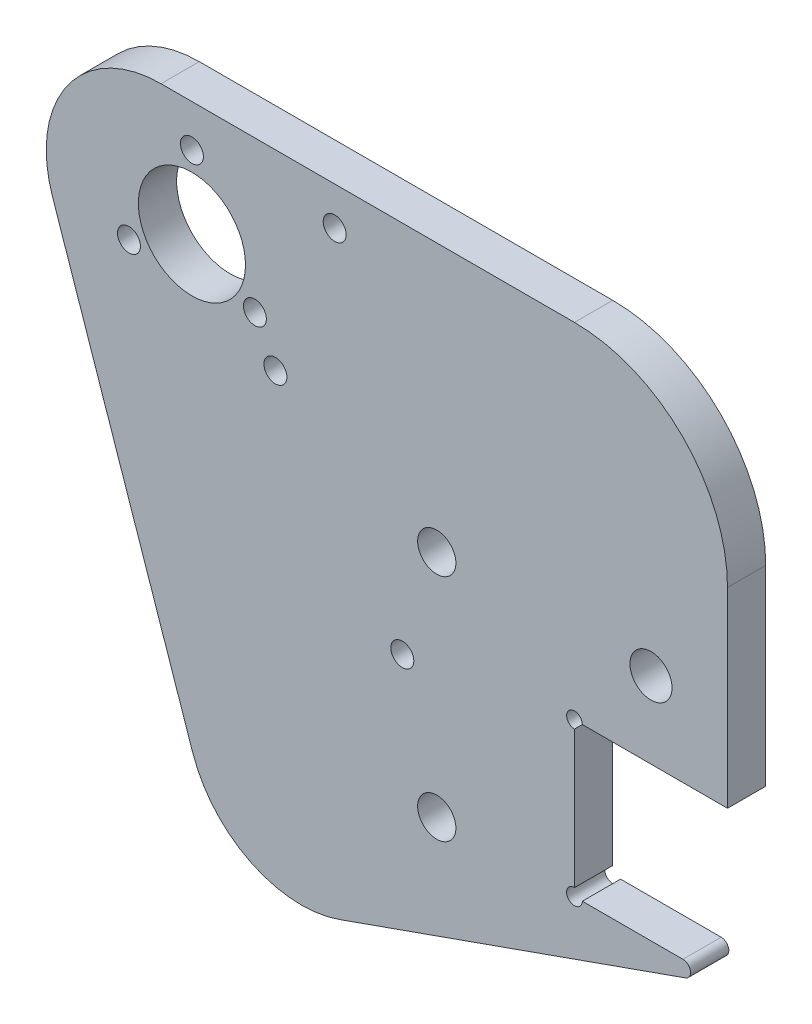
ISO-10303-21;
HEADER;
FILE_DESCRIPTION(('STEP AP214'),'2;1');
FILE_NAME('part.step','',(''),(''),'','','');
FILE_SCHEMA(('AUTOMOTIVE_DESIGN { 1 0 10303 214 1 1 1 1 }'));
ENDSEC;
DATA;
#1=APPLICATION_CONTEXT('core data for automotive mechanical design processes');
#2=APPLICATION_PROTOCOL_DEFINITION('international standard','automotive_design',2000,#1);
#3=PRODUCT_CONTEXT('',#1,'mechanical');
#4=PRODUCT('Part','Part','',(#3));
#5=PRODUCT_RELATED_PRODUCT_CATEGORY('part','',(#4));
#6=PRODUCT_DEFINITION_FORMATION('','',#4);
#7=PRODUCT_DEFINITION_CONTEXT('part definition',#1,'design');
#8=PRODUCT_DEFINITION('design','',#6,#7);
#9=PRODUCT_DEFINITION_SHAPE('','',#8);
#10=(LENGTH_UNIT() NAMED_UNIT(*) SI_UNIT(.MILLI.,.METRE.));
#11=(NAMED_UNIT(*) PLANE_ANGLE_UNIT() SI_UNIT($,.RADIAN.));
#12=(NAMED_UNIT(*) SI_UNIT($,.STERADIAN.) SOLID_ANGLE_UNIT());
#13=UNCERTAINTY_MEASURE_WITH_UNIT(LENGTH_MEASURE(1.E-05),#10,'distance_accuracy_value','');
#14=(GEOMETRIC_REPRESENTATION_CONTEXT(3) GLOBAL_UNCERTAINTY_ASSIGNED_CONTEXT((#13)) GLOBAL_UNIT_ASSIGNED_CONTEXT((#10,
#11,#12)) REPRESENTATION_CONTEXT('',''));
#15=CARTESIAN_POINT('',(0.,0.,0.));
#16=DIRECTION('',(0.,0.,1.));
#17=DIRECTION('',(1.,0.,0.));
#18=AXIS2_PLACEMENT_3D('',#15,#16,#17);
#19=CARTESIAN_POINT('',(50.,-5.,-5.));
#20=DIRECTION('',(0.,0.,-1.));
#21=DIRECTION('',(1.,0.,0.));
#22=AXIS2_PLACEMENT_3D('',#19,#20,#21);
#23=PLANE('',#22);
#24=CARTESIAN_POINT('',(50.,-50.,-5.));
#25=DIRECTION('',(0.,0.,1.));
#26=DIRECTION('',(1.,0.,0.));
#27=AXIS2_PLACEMENT_3D('',#24,#25,#26);
#28=CIRCLE('',#27,1.025);
#29=CARTESIAN_POINT('',(50.,-48.975,-5.));
#30=VERTEX_POINT('',#29);
#31=CARTESIAN_POINT('',(51.025,-50.,-5.));
#32=VERTEX_POINT('',#31);
#33=EDGE_CURVE('E145',#30,#32,#28,.T.);
#34=ORIENTED_EDGE('',*,*,#33,.T.);
#35=DIRECTION('',(-1.,0.,0.));
#36=VECTOR('',#35,1.);
#37=CARTESIAN_POINT('',(50.,-50.,-5.));
#38=LINE('',#37,#36);
#39=CARTESIAN_POINT('',(64.1761192737499,-50.,-5.));
#40=VERTEX_POINT('',#39);
#41=EDGE_CURVE('E135',#40,#32,#38,.T.);
#42=ORIENTED_EDGE('',*,*,#41,.F.);
#43=CARTESIAN_POINT('',(64.1761192737499,-51.,-5.));
#44=DIRECTION('',(0.,0.,1.));
#45=DIRECTION('',(1.,0.,0.));
#46=AXIS2_PLACEMENT_3D('',#43,#44,#45);
#47=CIRCLE('',#46,1.);
#48=CARTESIAN_POINT('',(64.5096979241888,-51.9427222729794,-5.));
#49=VERTEX_POINT('',#48);
#50=EDGE_CURVE('E137',#49,#40,#47,.T.);
#51=ORIENTED_EDGE('',*,*,#50,.F.);
#52=DIRECTION('',(0.942722272979372,0.333578650438854,0.));
#53=VECTOR('',#52,1.);
#54=CARTESIAN_POINT('',(19.3050246890061,-67.9382220331209,-5.));
#55=LINE('',#54,#53);
#56=CARTESIAN_POINT('',(19.3050246890061,-67.9382220331209,-5.));
#57=VERTEX_POINT('',#56);
#58=EDGE_CURVE('E272',#57,#49,#55,.T.);
#59=ORIENTED_EDGE('',*,*,#58,.F.);
#60=CARTESIAN_POINT('',(14.3013449324233,-53.7973879384304,-5.));
#61=DIRECTION('',(0.,0.,1.));
#62=DIRECTION('',(1.,0.,0.));
#63=AXIS2_PLACEMENT_3D('',#60,#61,#62);
#64=CIRCLE('',#63,15.);
#65=CARTESIAN_POINT('',(0.103692109745153,-58.6374968552524,-5.));
#66=VERTEX_POINT('',#65);
#67=EDGE_CURVE('E269',#66,#57,#64,.T.);
#68=ORIENTED_EDGE('',*,*,#67,.F.);
#69=DIRECTION('',(0.322673927788139,-0.94651018817854,0.));
#70=VECTOR('',#69,1.);
#71=CARTESIAN_POINT('',(-18.2363265056288,-4.84010891682209,-5.));
#72=LINE('',#71,#70);
#73=CARTESIAN_POINT('',(-18.2363265056288,-4.84010891682209,-5.));
#74=VERTEX_POINT('',#73);
#75=EDGE_CURVE('E266',#74,#66,#72,.T.);
#76=ORIENTED_EDGE('',*,*,#75,.F.);
#77=CARTESIAN_POINT('',(-4.03867368295073,0.,-5.));
#78=DIRECTION('',(0.,0.,1.));
#79=DIRECTION('',(1.,0.,0.));
#80=AXIS2_PLACEMENT_3D('',#77,#78,#79);
#81=CIRCLE('',#80,15.);
#82=CARTESIAN_POINT('',(-4.03867368295073,15.,-5.));
#83=VERTEX_POINT('',#82);
#84=EDGE_CURVE('E263',#83,#74,#81,.T.);
#85=ORIENTED_EDGE('',*,*,#84,.F.);
#86=DIRECTION('',(-1.,0.,0.));
#87=VECTOR('',#86,1.);
#88=CARTESIAN_POINT('',(50.,15.,-5.));
#89=LINE('',#88,#87);
#90=CARTESIAN_POINT('',(50.,15.,-5.));
#91=VERTEX_POINT('',#90);
#92=EDGE_CURVE('E260',#91,#83,#89,.T.);
#93=ORIENTED_EDGE('',*,*,#92,.F.);
#94=CARTESIAN_POINT('',(50.,-5.,-5.));
#95=DIRECTION('',(0.,0.,1.));
#96=DIRECTION('',(1.,0.,0.));
#97=AXIS2_PLACEMENT_3D('',#94,#95,#96);
#98=CIRCLE('',#97,20.);
#99=CARTESIAN_POINT('',(70.,-5.,-5.));
#100=VERTEX_POINT('',#99);
#101=EDGE_CURVE('E257',#100,#91,#98,.T.);
#102=ORIENTED_EDGE('',*,*,#101,.F.);
#103=DIRECTION('',(0.,1.,0.));
#104=VECTOR('',#103,1.);
#105=CARTESIAN_POINT('',(70.,-30.,-5.));
#106=LINE('',#105,#104);
#107=CARTESIAN_POINT('',(70.,-30.,-5.));
#108=VERTEX_POINT('',#107);
#109=EDGE_CURVE('E254',#108,#100,#106,.T.);
#110=ORIENTED_EDGE('',*,*,#109,.F.);
#111=DIRECTION('',(1.,0.,0.));
#112=VECTOR('',#111,1.);
#113=CARTESIAN_POINT('',(50.,-30.,-5.));
#114=LINE('',#113,#112);
#115=CARTESIAN_POINT('',(51.025,-30.,-5.));
#116=VERTEX_POINT('',#115);
#117=EDGE_CURVE('E156',#116,#108,#114,.T.);
#118=ORIENTED_EDGE('',*,*,#117,.F.);
#119=CARTESIAN_POINT('',(50.,-30.,-5.));
#120=DIRECTION('',(0.,0.,1.));
#121=DIRECTION('',(1.,0.,0.));
#122=AXIS2_PLACEMENT_3D('',#119,#120,#121);
#123=CIRCLE('',#122,1.025);
#124=CARTESIAN_POINT('',(50.,-31.025,-5.));
#125=VERTEX_POINT('',#124);
#126=EDGE_CURVE('E208',#116,#125,#123,.T.);
#127=ORIENTED_EDGE('',*,*,#126,.T.);
#128=DIRECTION('',(0.,1.,0.));
#129=VECTOR('',#128,1.);
#130=CARTESIAN_POINT('',(50.,-50.,-5.));
#131=LINE('',#130,#129);
#132=EDGE_CURVE('E152',#30,#125,#131,.T.);
#133=ORIENTED_EDGE('',*,*,#132,.F.);
#134=EDGE_LOOP('',(#34,#42,#51,#59,#68,#76,#85,#93,#102,#110,#118,#127,#133));
#135=FACE_BOUND('',#134,.T.);
#136=CARTESIAN_POINT('',(10.914424011663,-10.,-5.));
#137=DIRECTION('',(0.,0.,1.));
#138=DIRECTION('',(1.,0.,0.));
#139=AXIS2_PLACEMENT_3D('',#136,#137,#138);
#140=CIRCLE('',#139,1.50000000000242);
#141=CARTESIAN_POINT('',(12.4144240116654,-10.,-5.));
#142=VERTEX_POINT('',#141);
#143=EDGE_CURVE('E197',#142,#142,#140,.T.);
#144=ORIENTED_EDGE('',*,*,#143,.T.);
#145=EDGE_LOOP('',(#144));
#146=FACE_BOUND('',#145,.T.);
#147=CARTESIAN_POINT('',(27.5,-33.82,-5.));
#148=DIRECTION('',(0.,0.,1.));
#149=DIRECTION('',(1.,0.,0.));
#150=AXIS2_PLACEMENT_3D('',#147,#148,#149);
#151=CIRCLE('',#150,1.5);
#152=CARTESIAN_POINT('',(29.,-33.82,-5.));
#153=VERTEX_POINT('',#152);
#154=EDGE_CURVE('E187',#153,#153,#151,.T.);
#155=ORIENTED_EDGE('',*,*,#154,.T.);
#156=EDGE_LOOP('',(#155));
#157=FACE_BOUND('',#156,.T.);
#158=CARTESIAN_POINT('',(18.66,10.,-5.));
#159=DIRECTION('',(0.,0.,1.));
#160=DIRECTION('',(1.,0.,0.));
#161=AXIS2_PLACEMENT_3D('',#158,#159,#160);
#162=CIRCLE('',#161,1.5);
#163=CARTESIAN_POINT('',(20.16,10.,-5.));
#164=VERTEX_POINT('',#163);
#165=EDGE_CURVE('E201',#164,#164,#162,.T.);
#166=ORIENTED_EDGE('',*,*,#165,.T.);
#167=EDGE_LOOP('',(#166));
#168=FACE_BOUND('',#167,.T.);
#169=CARTESIAN_POINT('',(60.0000000000001,-20.0000000000002,-5.));
#170=DIRECTION('',(0.,0.,1.));
#171=DIRECTION('',(1.,0.,0.));
#172=AXIS2_PLACEMENT_3D('',#169,#170,#171);
#173=CIRCLE('',#172,2.75000000000005);
#174=CARTESIAN_POINT('',(62.7500000000001,-20.0000000000002,-5.));
#175=VERTEX_POINT('',#174);
#176=EDGE_CURVE('E196',#175,#175,#173,.T.);
#177=ORIENTED_EDGE('',*,*,#176,.T.);
#178=EDGE_LOOP('',(#177));
#179=FACE_BOUND('',#178,.T.);
#180=CARTESIAN_POINT('',(32.,-50.,-5.));
#181=DIRECTION('',(0.,0.,1.));
#182=DIRECTION('',(1.,0.,0.));
#183=AXIS2_PLACEMENT_3D('',#180,#181,#182);
#184=CIRCLE('',#183,2.5);
#185=CARTESIAN_POINT('',(34.5,-50.,-5.));
#186=VERTEX_POINT('',#185);
#187=EDGE_CURVE('E222',#186,#186,#184,.T.);
#188=ORIENTED_EDGE('',*,*,#187,.T.);
#189=EDGE_LOOP('',(#188));
#190=FACE_BOUND('',#189,.T.);
#191=CARTESIAN_POINT('',(8.22724133595217,-4.75,-5.));
#192=DIRECTION('',(0.,0.,1.));
#193=DIRECTION('',(1.,0.,0.));
#194=AXIS2_PLACEMENT_3D('',#191,#192,#193);
#195=CIRCLE('',#194,1.5);
#196=CARTESIAN_POINT('',(9.72724133595217,-4.75,-5.));
#197=VERTEX_POINT('',#196);
#198=EDGE_CURVE('E234',#197,#197,#195,.T.);
#199=ORIENTED_EDGE('',*,*,#198,.T.);
#200=EDGE_LOOP('',(#199));
#201=FACE_BOUND('',#200,.T.);
#202=CARTESIAN_POINT('',(0.,0.,-5.));
#203=DIRECTION('',(0.,0.,1.));
#204=DIRECTION('',(1.,0.,0.));
#205=AXIS2_PLACEMENT_3D('',#202,#203,#204);
#206=CIRCLE('',#205,7.);
#207=CARTESIAN_POINT('',(7.,0.,-5.));
#208=VERTEX_POINT('',#207);
#209=EDGE_CURVE('E246',#208,#208,#206,.T.);
#210=ORIENTED_EDGE('',*,*,#209,.T.);
#211=EDGE_LOOP('',(#210));
#212=FACE_BOUND('',#211,.T.);
#213=CARTESIAN_POINT('',(0.,9.5,-5.));
#214=DIRECTION('',(0.,0.,1.));
#215=DIRECTION('',(1.,0.,0.));
#216=AXIS2_PLACEMENT_3D('',#213,#214,#215);
#217=CIRCLE('',#216,1.5);
#218=CARTESIAN_POINT('',(1.5,9.5,-5.));
#219=VERTEX_POINT('',#218);
#220=EDGE_CURVE('E240',#219,#219,#217,.T.);
#221=ORIENTED_EDGE('',*,*,#220,.T.);
#222=EDGE_LOOP('',(#221));
#223=FACE_BOUND('',#222,.T.);
#224=CARTESIAN_POINT('',(-8.22724133595217,-4.75,-5.));
#225=DIRECTION('',(0.,0.,1.));
#226=DIRECTION('',(1.,0.,0.));
#227=AXIS2_PLACEMENT_3D('',#224,#225,#226);
#228=CIRCLE('',#227,1.5);
#229=CARTESIAN_POINT('',(-6.72724133595217,-4.75,-5.));
#230=VERTEX_POINT('',#229);
#231=EDGE_CURVE('E228',#230,#230,#228,.T.);
#232=ORIENTED_EDGE('',*,*,#231,.T.);
#233=EDGE_LOOP('',(#232));
#234=FACE_BOUND('',#233,.T.);
#235=CARTESIAN_POINT('',(32.,-20.,-5.));
#236=DIRECTION('',(0.,0.,1.));
#237=DIRECTION('',(1.,0.,0.));
#238=AXIS2_PLACEMENT_3D('',#235,#236,#237);
#239=CIRCLE('',#238,2.5);
#240=CARTESIAN_POINT('',(34.5,-20.,-5.));
#241=VERTEX_POINT('',#240);
#242=EDGE_CURVE('E216',#241,#241,#239,.T.);
#243=ORIENTED_EDGE('',*,*,#242,.T.);
#244=EDGE_LOOP('',(#243));
#245=FACE_BOUND('',#244,.T.);
#246=ADVANCED_FACE('F37',(#135,#146,#157,#168,#179,#190,#201,#212,#223,#234,#245),#23,.T.);
#247=CARTESIAN_POINT('',(50.,-5.,0.));
#248=DIRECTION('',(0.,0.,-1.));
#249=DIRECTION('',(1.,0.,0.));
#250=AXIS2_PLACEMENT_3D('',#247,#248,#249);
#251=PLANE('',#250);
#252=CARTESIAN_POINT('',(10.914424011663,-10.,0.));
#253=DIRECTION('',(0.,0.,1.));
#254=DIRECTION('',(1.,0.,0.));
#255=AXIS2_PLACEMENT_3D('',#252,#253,#254);
#256=CIRCLE('',#255,1.50000000000242);
#257=CARTESIAN_POINT('',(12.4144240116654,-10.,0.));
#258=VERTEX_POINT('',#257);
#259=EDGE_CURVE('E194',#258,#258,#256,.T.);
#260=ORIENTED_EDGE('',*,*,#259,.F.);
#261=EDGE_LOOP('',(#260));
#262=FACE_BOUND('',#261,.T.);
#263=CARTESIAN_POINT('',(27.5,-33.82,0.));
#264=DIRECTION('',(0.,0.,1.));
#265=DIRECTION('',(1.,0.,0.));
#266=AXIS2_PLACEMENT_3D('',#263,#264,#265);
#267=CIRCLE('',#266,1.5);
#268=CARTESIAN_POINT('',(29.,-33.82,0.));
#269=VERTEX_POINT('',#268);
#270=EDGE_CURVE('E190',#269,#269,#267,.T.);
#271=ORIENTED_EDGE('',*,*,#270,.F.);
#272=EDGE_LOOP('',(#271));
#273=FACE_BOUND('',#272,.T.);
#274=CARTESIAN_POINT('',(18.66,10.,0.));
#275=DIRECTION('',(0.,0.,1.));
#276=DIRECTION('',(1.,0.,0.));
#277=AXIS2_PLACEMENT_3D('',#274,#275,#276);
#278=CIRCLE('',#277,1.5);
#279=CARTESIAN_POINT('',(20.16,10.,0.));
#280=VERTEX_POINT('',#279);
#281=EDGE_CURVE('E186',#280,#280,#278,.T.);
#282=ORIENTED_EDGE('',*,*,#281,.F.);
#283=EDGE_LOOP('',(#282));
#284=FACE_BOUND('',#283,.T.);
#285=CARTESIAN_POINT('',(60.0000000000001,-20.0000000000002,0.));
#286=DIRECTION('',(0.,0.,1.));
#287=DIRECTION('',(1.,0.,0.));
#288=AXIS2_PLACEMENT_3D('',#285,#286,#287);
#289=CIRCLE('',#288,2.75000000000005);
#290=CARTESIAN_POINT('',(62.7500000000001,-20.0000000000002,0.));
#291=VERTEX_POINT('',#290);
#292=EDGE_CURVE('E183',#291,#291,#289,.T.);
#293=ORIENTED_EDGE('',*,*,#292,.F.);
#294=EDGE_LOOP('',(#293));
#295=FACE_BOUND('',#294,.T.);
#296=DIRECTION('',(0.,1.,0.));
#297=VECTOR('',#296,1.);
#298=CARTESIAN_POINT('',(50.,-50.,0.));
#299=LINE('',#298,#297);
#300=CARTESIAN_POINT('',(50.,-48.975,0.));
#301=VERTEX_POINT('',#300);
#302=CARTESIAN_POINT('',(50.,-31.025,0.));
#303=VERTEX_POINT('',#302);
#304=EDGE_CURVE('E249',#301,#303,#299,.T.);
#305=ORIENTED_EDGE('',*,*,#304,.T.);
#306=CARTESIAN_POINT('',(50.,-30.,0.));
#307=DIRECTION('',(0.,0.,1.));
#308=DIRECTION('',(1.,0.,0.));
#309=AXIS2_PLACEMENT_3D('',#306,#307,#308);
#310=CIRCLE('',#309,1.025);
#311=CARTESIAN_POINT('',(51.025,-30.,0.));
#312=VERTEX_POINT('',#311);
#313=EDGE_CURVE('E310',#312,#303,#310,.T.);
#314=ORIENTED_EDGE('',*,*,#313,.F.);
#315=DIRECTION('',(1.,0.,0.));
#316=VECTOR('',#315,1.);
#317=CARTESIAN_POINT('',(50.,-30.,0.));
#318=LINE('',#317,#316);
#319=CARTESIAN_POINT('',(70.,-30.,0.));
#320=VERTEX_POINT('',#319);
#321=EDGE_CURVE('E277',#312,#320,#318,.T.);
#322=ORIENTED_EDGE('',*,*,#321,.T.);
#323=DIRECTION('',(0.,1.,0.));
#324=VECTOR('',#323,1.);
#325=CARTESIAN_POINT('',(70.,-30.,0.));
#326=LINE('',#325,#324);
#327=CARTESIAN_POINT('',(70.,-5.,0.));
#328=VERTEX_POINT('',#327);
#329=EDGE_CURVE('E280',#320,#328,#326,.T.);
#330=ORIENTED_EDGE('',*,*,#329,.T.);
#331=CARTESIAN_POINT('',(50.,-5.,0.));
#332=DIRECTION('',(0.,0.,1.));
#333=DIRECTION('',(1.,0.,0.));
#334=AXIS2_PLACEMENT_3D('',#331,#332,#333);
#335=CIRCLE('',#334,20.);
#336=CARTESIAN_POINT('',(50.,15.,0.));
#337=VERTEX_POINT('',#336);
#338=EDGE_CURVE('E283',#328,#337,#335,.T.);
#339=ORIENTED_EDGE('',*,*,#338,.T.);
#340=DIRECTION('',(-1.,0.,0.));
#341=VECTOR('',#340,1.);
#342=CARTESIAN_POINT('',(50.,15.,0.));
#343=LINE('',#342,#341);
#344=CARTESIAN_POINT('',(-4.03867368295073,15.,0.));
#345=VERTEX_POINT('',#344);
#346=EDGE_CURVE('E286',#337,#345,#343,.T.);
#347=ORIENTED_EDGE('',*,*,#346,.T.);
#348=CARTESIAN_POINT('',(-4.03867368295073,0.,0.));
#349=DIRECTION('',(0.,0.,1.));
#350=DIRECTION('',(1.,0.,0.));
#351=AXIS2_PLACEMENT_3D('',#348,#349,#350);
#352=CIRCLE('',#351,15.);
#353=CARTESIAN_POINT('',(-18.2363265056288,-4.84010891682209,0.));
#354=VERTEX_POINT('',#353);
#355=EDGE_CURVE('E289',#345,#354,#352,.T.);
#356=ORIENTED_EDGE('',*,*,#355,.T.);
#357=DIRECTION('',(0.322673927788139,-0.94651018817854,0.));
#358=VECTOR('',#357,1.);
#359=CARTESIAN_POINT('',(-18.2363265056288,-4.84010891682209,0.));
#360=LINE('',#359,#358);
#361=CARTESIAN_POINT('',(0.103692109745153,-58.6374968552524,0.));
#362=VERTEX_POINT('',#361);
#363=EDGE_CURVE('E292',#354,#362,#360,.T.);
#364=ORIENTED_EDGE('',*,*,#363,.T.);
#365=CARTESIAN_POINT('',(14.3013449324233,-53.7973879384304,0.));
#366=DIRECTION('',(0.,0.,1.));
#367=DIRECTION('',(1.,0.,0.));
#368=AXIS2_PLACEMENT_3D('',#365,#366,#367);
#369=CIRCLE('',#368,15.);
#370=CARTESIAN_POINT('',(19.3050246890061,-67.9382220331209,0.));
#371=VERTEX_POINT('',#370);
#372=EDGE_CURVE('E158',#362,#371,#369,.T.);
#373=ORIENTED_EDGE('',*,*,#372,.T.);
#374=DIRECTION('',(0.942722272979372,0.333578650438854,0.));
#375=VECTOR('',#374,1.);
#376=CARTESIAN_POINT('',(19.3050246890061,-67.9382220331209,0.));
#377=LINE('',#376,#375);
#378=CARTESIAN_POINT('',(64.5096979241888,-51.9427222729794,0.));
#379=VERTEX_POINT('',#378);
#380=EDGE_CURVE('E153',#371,#379,#377,.T.);
#381=ORIENTED_EDGE('',*,*,#380,.T.);
#382=CARTESIAN_POINT('',(64.1761192737499,-51.,0.));
#383=DIRECTION('',(0.,0.,1.));
#384=DIRECTION('',(1.,0.,0.));
#385=AXIS2_PLACEMENT_3D('',#382,#383,#384);
#386=CIRCLE('',#385,1.);
#387=CARTESIAN_POINT('',(64.1761192737499,-50.,0.));
#388=VERTEX_POINT('',#387);
#389=EDGE_CURVE('E151',#388,#379,#386,.F.);
#390=ORIENTED_EDGE('',*,*,#389,.F.);
#391=DIRECTION('',(-1.,0.,0.));
#392=VECTOR('',#391,1.);
#393=CARTESIAN_POINT('',(50.,-50.,0.));
#394=LINE('',#393,#392);
#395=CARTESIAN_POINT('',(51.025,-50.,0.));
#396=VERTEX_POINT('',#395);
#397=EDGE_CURVE('E132',#388,#396,#394,.T.);
#398=ORIENTED_EDGE('',*,*,#397,.T.);
#399=CARTESIAN_POINT('',(50.,-50.,0.));
#400=DIRECTION('',(0.,0.,1.));
#401=DIRECTION('',(1.,0.,0.));
#402=AXIS2_PLACEMENT_3D('',#399,#400,#401);
#403=CIRCLE('',#402,1.025);
#404=EDGE_CURVE('E139',#301,#396,#403,.T.);
#405=ORIENTED_EDGE('',*,*,#404,.F.);
#406=EDGE_LOOP('',(#305,#314,#322,#330,#339,#347,#356,#364,#373,#381,#390,#398,#405));
#407=FACE_BOUND('',#406,.T.);
#408=CARTESIAN_POINT('',(0.,0.,0.));
#409=DIRECTION('',(0.,0.,1.));
#410=DIRECTION('',(1.,0.,0.));
#411=AXIS2_PLACEMENT_3D('',#408,#409,#410);
#412=CIRCLE('',#411,7.);
#413=CARTESIAN_POINT('',(7.,0.,0.));
#414=VERTEX_POINT('',#413);
#415=EDGE_CURVE('E243',#414,#414,#412,.T.);
#416=ORIENTED_EDGE('',*,*,#415,.F.);
#417=EDGE_LOOP('',(#416));
#418=FACE_BOUND('',#417,.T.);
#419=CARTESIAN_POINT('',(0.,9.5,0.));
#420=DIRECTION('',(0.,0.,1.));
#421=DIRECTION('',(1.,0.,0.));
#422=AXIS2_PLACEMENT_3D('',#419,#420,#421);
#423=CIRCLE('',#422,1.5);
#424=CARTESIAN_POINT('',(1.5,9.5,0.));
#425=VERTEX_POINT('',#424);
#426=EDGE_CURVE('E237',#425,#425,#423,.T.);
#427=ORIENTED_EDGE('',*,*,#426,.F.);
#428=EDGE_LOOP('',(#427));
#429=FACE_BOUND('',#428,.T.);
#430=CARTESIAN_POINT('',(8.22724133595217,-4.75,0.));
#431=DIRECTION('',(0.,0.,1.));
#432=DIRECTION('',(1.,0.,0.));
#433=AXIS2_PLACEMENT_3D('',#430,#431,#432);
#434=CIRCLE('',#433,1.5);
#435=CARTESIAN_POINT('',(9.72724133595217,-4.75,0.));
#436=VERTEX_POINT('',#435);
#437=EDGE_CURVE('E231',#436,#436,#434,.T.);
#438=ORIENTED_EDGE('',*,*,#437,.F.);
#439=EDGE_LOOP('',(#438));
#440=FACE_BOUND('',#439,.T.);
#441=CARTESIAN_POINT('',(-8.22724133595217,-4.75,0.));
#442=DIRECTION('',(0.,0.,1.));
#443=DIRECTION('',(1.,0.,0.));
#444=AXIS2_PLACEMENT_3D('',#441,#442,#443);
#445=CIRCLE('',#444,1.5);
#446=CARTESIAN_POINT('',(-6.72724133595217,-4.75,0.));
#447=VERTEX_POINT('',#446);
#448=EDGE_CURVE('E225',#447,#447,#445,.T.);
#449=ORIENTED_EDGE('',*,*,#448,.F.);
#450=EDGE_LOOP('',(#449));
#451=FACE_BOUND('',#450,.T.);
#452=CARTESIAN_POINT('',(32.,-50.,0.));
#453=DIRECTION('',(0.,0.,1.));
#454=DIRECTION('',(1.,0.,0.));
#455=AXIS2_PLACEMENT_3D('',#452,#453,#454);
#456=CIRCLE('',#455,2.5);
#457=CARTESIAN_POINT('',(34.5,-50.,0.));
#458=VERTEX_POINT('',#457);
#459=EDGE_CURVE('E219',#458,#458,#456,.T.);
#460=ORIENTED_EDGE('',*,*,#459,.F.);
#461=EDGE_LOOP('',(#460));
#462=FACE_BOUND('',#461,.T.);
#463=CARTESIAN_POINT('',(32.,-20.,0.));
#464=DIRECTION('',(0.,0.,1.));
#465=DIRECTION('',(1.,0.,0.));
#466=AXIS2_PLACEMENT_3D('',#463,#464,#465);
#467=CIRCLE('',#466,2.5);
#468=CARTESIAN_POINT('',(34.5,-20.,0.));
#469=VERTEX_POINT('',#468);
#470=EDGE_CURVE('E193',#469,#469,#467,.T.);
#471=ORIENTED_EDGE('',*,*,#470,.F.);
#472=EDGE_LOOP('',(#471));
#473=FACE_BOUND('',#472,.T.);
#474=ADVANCED_FACE('F147',(#262,#273,#284,#295,#407,#418,#429,#440,#451,#462,#473),#251,.F.);
#475=CARTESIAN_POINT('',(50.,-50.,-5.));
#476=DIRECTION('',(-1.,0.,0.));
#477=DIRECTION('',(0.,0.,-1.));
#478=AXIS2_PLACEMENT_3D('',#475,#476,#477);
#479=PLANE('',#478);
#480=ORIENTED_EDGE('',*,*,#132,.T.);
#481=DIRECTION('',(0.,0.,1.));
#482=VECTOR('',#481,1.);
#483=CARTESIAN_POINT('',(50.,-31.025,-30.));
#484=LINE('',#483,#482);
#485=EDGE_CURVE('E204',#303,#125,#484,.F.);
#486=ORIENTED_EDGE('',*,*,#485,.F.);
#487=ORIENTED_EDGE('',*,*,#304,.F.);
#488=DIRECTION('',(0.,0.,1.));
#489=VECTOR('',#488,1.);
#490=CARTESIAN_POINT('',(50.,-48.975,-30.));
#491=LINE('',#490,#489);
#492=EDGE_CURVE('E141',#30,#301,#491,.T.);
#493=ORIENTED_EDGE('',*,*,#492,.F.);
#494=EDGE_LOOP('',(#480,#486,#487,#493));
#495=FACE_BOUND('',#494,.T.);
#496=ADVANCED_FACE('F318',(#495),#479,.F.);
#497=CARTESIAN_POINT('',(50.,-30.,-5.));
#498=DIRECTION('',(0.,1.,0.));
#499=DIRECTION('',(0.,0.,-1.));
#500=AXIS2_PLACEMENT_3D('',#497,#498,#499);
#501=PLANE('',#500);
#502=ORIENTED_EDGE('',*,*,#117,.T.);
#503=DIRECTION('',(0.,0.,1.));
#504=VECTOR('',#503,1.);
#505=CARTESIAN_POINT('',(70.,-30.,-5.));
#506=LINE('',#505,#504);
#507=EDGE_CURVE('E174',#108,#320,#506,.T.);
#508=ORIENTED_EDGE('',*,*,#507,.T.);
#509=ORIENTED_EDGE('',*,*,#321,.F.);
#510=DIRECTION('',(0.,0.,1.));
#511=VECTOR('',#510,1.);
#512=CARTESIAN_POINT('',(51.025,-30.,-30.));
#513=LINE('',#512,#511);
#514=EDGE_CURVE('E11',#116,#312,#513,.T.);
#515=ORIENTED_EDGE('',*,*,#514,.F.);
#516=EDGE_LOOP('',(#502,#508,#509,#515));
#517=FACE_BOUND('',#516,.T.);
#518=ADVANCED_FACE('F321',(#517),#501,.F.);
#519=CARTESIAN_POINT('',(70.,-30.,-5.));
#520=DIRECTION('',(-1.,0.,0.));
#521=DIRECTION('',(0.,0.,-1.));
#522=AXIS2_PLACEMENT_3D('',#519,#520,#521);
#523=PLANE('',#522);
#524=ORIENTED_EDGE('',*,*,#329,.F.);
#525=ORIENTED_EDGE('',*,*,#507,.F.);
#526=ORIENTED_EDGE('',*,*,#109,.T.);
#527=DIRECTION('',(0.,0.,1.));
#528=VECTOR('',#527,1.);
#529=CARTESIAN_POINT('',(70.,-5.,-5.));
#530=LINE('',#529,#528);
#531=EDGE_CURVE('E172',#100,#328,#530,.T.);
#532=ORIENTED_EDGE('',*,*,#531,.T.);
#533=EDGE_LOOP('',(#524,#525,#526,#532));
#534=FACE_BOUND('',#533,.T.);
#535=ADVANCED_FACE('F323',(#534),#523,.F.);
#536=CARTESIAN_POINT('',(50.,-5.,-5.));
#537=DIRECTION('',(0.,0.,1.));
#538=DIRECTION('',(-1.,0.,0.));
#539=AXIS2_PLACEMENT_3D('',#536,#537,#538);
#540=CYLINDRICAL_SURFACE('',#539,20.);
#541=ORIENTED_EDGE('',*,*,#338,.F.);
#542=ORIENTED_EDGE('',*,*,#531,.F.);
#543=ORIENTED_EDGE('',*,*,#101,.T.);
#544=DIRECTION('',(0.,0.,1.));
#545=VECTOR('',#544,1.);
#546=CARTESIAN_POINT('',(50.,15.,-5.));
#547=LINE('',#546,#545);
#548=EDGE_CURVE('E170',#91,#337,#547,.T.);
#549=ORIENTED_EDGE('',*,*,#548,.T.);
#550=EDGE_LOOP('',(#541,#542,#543,#549));
#551=FACE_BOUND('',#550,.T.);
#552=ADVANCED_FACE('F327',(#551),#540,.T.);
#553=CARTESIAN_POINT('',(50.,15.,-5.));
#554=DIRECTION('',(0.,-1.,0.));
#555=DIRECTION('',(1.,0.,0.));
#556=AXIS2_PLACEMENT_3D('',#553,#554,#555);
#557=PLANE('',#556);
#558=ORIENTED_EDGE('',*,*,#346,.F.);
#559=ORIENTED_EDGE('',*,*,#548,.F.);
#560=ORIENTED_EDGE('',*,*,#92,.T.);
#561=DIRECTION('',(0.,0.,1.));
#562=VECTOR('',#561,1.);
#563=CARTESIAN_POINT('',(-4.03867368295073,15.,-5.));
#564=LINE('',#563,#562);
#565=EDGE_CURVE('E168',#83,#345,#564,.T.);
#566=ORIENTED_EDGE('',*,*,#565,.T.);
#567=EDGE_LOOP('',(#558,#559,#560,#566));
#568=FACE_BOUND('',#567,.T.);
#569=ADVANCED_FACE('F331',(#568),#557,.F.);
#570=CARTESIAN_POINT('',(-4.03867368295073,0.,-5.));
#571=DIRECTION('',(0.,0.,1.));
#572=DIRECTION('',(-1.,0.,0.));
#573=AXIS2_PLACEMENT_3D('',#570,#571,#572);
#574=CYLINDRICAL_SURFACE('',#573,15.);
#575=ORIENTED_EDGE('',*,*,#355,.F.);
#576=ORIENTED_EDGE('',*,*,#565,.F.);
#577=ORIENTED_EDGE('',*,*,#84,.T.);
#578=DIRECTION('',(0.,0.,1.));
#579=VECTOR('',#578,1.);
#580=CARTESIAN_POINT('',(-18.2363265056288,-4.84010891682209,-5.));
#581=LINE('',#580,#579);
#582=EDGE_CURVE('E166',#74,#354,#581,.T.);
#583=ORIENTED_EDGE('',*,*,#582,.T.);
#584=EDGE_LOOP('',(#575,#576,#577,#583));
#585=FACE_BOUND('',#584,.T.);
#586=ADVANCED_FACE('F335',(#585),#574,.T.);
#587=CARTESIAN_POINT('',(-18.2363265056288,-4.84010891682209,-5.));
#588=DIRECTION('',(0.94651018817854,0.322673927788139,0.));
#589=DIRECTION('',(-0.322673927788139,0.94651018817854,0.));
#590=AXIS2_PLACEMENT_3D('',#587,#588,#589);
#591=PLANE('',#590);
#592=ORIENTED_EDGE('',*,*,#363,.F.);
#593=ORIENTED_EDGE('',*,*,#582,.F.);
#594=ORIENTED_EDGE('',*,*,#75,.T.);
#595=DIRECTION('',(0.,0.,1.));
#596=VECTOR('',#595,1.);
#597=CARTESIAN_POINT('',(0.103692109745153,-58.6374968552524,-5.));
#598=LINE('',#597,#596);
#599=EDGE_CURVE('E164',#66,#362,#598,.T.);
#600=ORIENTED_EDGE('',*,*,#599,.T.);
#601=EDGE_LOOP('',(#592,#593,#594,#600));
#602=FACE_BOUND('',#601,.T.);
#603=ADVANCED_FACE('F338',(#602),#591,.F.);
#604=CARTESIAN_POINT('',(14.3013449324233,-53.7973879384304,-5.));
#605=DIRECTION('',(0.,0.,1.));
#606=DIRECTION('',(-1.,0.,0.));
#607=AXIS2_PLACEMENT_3D('',#604,#605,#606);
#608=CYLINDRICAL_SURFACE('',#607,15.);
#609=ORIENTED_EDGE('',*,*,#372,.F.);
#610=ORIENTED_EDGE('',*,*,#599,.F.);
#611=ORIENTED_EDGE('',*,*,#67,.T.);
#612=DIRECTION('',(0.,0.,1.));
#613=VECTOR('',#612,1.);
#614=CARTESIAN_POINT('',(19.3050246890061,-67.9382220331209,-5.));
#615=LINE('',#614,#613);
#616=EDGE_CURVE('E162',#57,#371,#615,.T.);
#617=ORIENTED_EDGE('',*,*,#616,.T.);
#618=EDGE_LOOP('',(#609,#610,#611,#617));
#619=FACE_BOUND('',#618,.T.);
#620=ADVANCED_FACE('F299',(#619),#608,.T.);
#621=CARTESIAN_POINT('',(19.3050246890061,-67.9382220331209,-5.));
#622=DIRECTION('',(-0.333578650438854,0.942722272979372,0.));
#623=DIRECTION('',(-0.942722272979372,-0.333578650438854,0.));
#624=AXIS2_PLACEMENT_3D('',#621,#622,#623);
#625=PLANE('',#624);
#626=ORIENTED_EDGE('',*,*,#380,.F.);
#627=ORIENTED_EDGE('',*,*,#616,.F.);
#628=ORIENTED_EDGE('',*,*,#58,.T.);
#629=DIRECTION('',(0.,0.,1.));
#630=VECTOR('',#629,1.);
#631=CARTESIAN_POINT('',(64.5096979241888,-51.9427222729794,-5.));
#632=LINE('',#631,#630);
#633=EDGE_CURVE('E179',#379,#49,#632,.F.);
#634=ORIENTED_EDGE('',*,*,#633,.F.);
#635=EDGE_LOOP('',(#626,#627,#628,#634));
#636=FACE_BOUND('',#635,.T.);
#637=ADVANCED_FACE('F303',(#636),#625,.F.);
#638=CARTESIAN_POINT('',(50.,-50.,-5.));
#639=DIRECTION('',(0.,-1.,0.));
#640=DIRECTION('',(0.,0.,1.));
#641=AXIS2_PLACEMENT_3D('',#638,#639,#640);
#642=PLANE('',#641);
#643=ORIENTED_EDGE('',*,*,#397,.F.);
#644=DIRECTION('',(0.,0.,1.));
#645=VECTOR('',#644,1.);
#646=CARTESIAN_POINT('',(64.1761192737499,-50.,-5.));
#647=LINE('',#646,#645);
#648=EDGE_CURVE('E176',#40,#388,#647,.T.);
#649=ORIENTED_EDGE('',*,*,#648,.F.);
#650=ORIENTED_EDGE('',*,*,#41,.T.);
#651=DIRECTION('',(0.,0.,1.));
#652=VECTOR('',#651,1.);
#653=CARTESIAN_POINT('',(51.025,-50.,-30.));
#654=LINE('',#653,#652);
#655=EDGE_CURVE('E45',#396,#32,#654,.F.);
#656=ORIENTED_EDGE('',*,*,#655,.F.);
#657=EDGE_LOOP('',(#643,#649,#650,#656));
#658=FACE_BOUND('',#657,.T.);
#659=ADVANCED_FACE('F130',(#658),#642,.F.);
#660=CARTESIAN_POINT('',(0.,0.,-5.));
#661=DIRECTION('',(0.,0.,1.));
#662=DIRECTION('',(-1.,0.,0.));
#663=AXIS2_PLACEMENT_3D('',#660,#661,#662);
#664=CYLINDRICAL_SURFACE('',#663,7.);
#665=ORIENTED_EDGE('',*,*,#209,.F.);
#666=EDGE_LOOP('',(#665));
#667=FACE_BOUND('',#666,.T.);
#668=ORIENTED_EDGE('',*,*,#415,.T.);
#669=EDGE_LOOP('',(#668));
#670=FACE_BOUND('',#669,.T.);
#671=ADVANCED_FACE('F355',(#667,#670),#664,.F.);
#672=CARTESIAN_POINT('',(0.,9.5,-5.));
#673=DIRECTION('',(0.,0.,1.));
#674=DIRECTION('',(-1.,0.,0.));
#675=AXIS2_PLACEMENT_3D('',#672,#673,#674);
#676=CYLINDRICAL_SURFACE('',#675,1.5);
#677=ORIENTED_EDGE('',*,*,#220,.F.);
#678=EDGE_LOOP('',(#677));
#679=FACE_BOUND('',#678,.T.);
#680=ORIENTED_EDGE('',*,*,#426,.T.);
#681=EDGE_LOOP('',(#680));
#682=FACE_BOUND('',#681,.T.);
#683=ADVANCED_FACE('F377',(#679,#682),#676,.F.);
#684=CARTESIAN_POINT('',(8.22724133595217,-4.75,-5.));
#685=DIRECTION('',(0.,0.,1.));
#686=DIRECTION('',(-1.,0.,0.));
#687=AXIS2_PLACEMENT_3D('',#684,#685,#686);
#688=CYLINDRICAL_SURFACE('',#687,1.5);
#689=ORIENTED_EDGE('',*,*,#198,.F.);
#690=EDGE_LOOP('',(#689));
#691=FACE_BOUND('',#690,.T.);
#692=ORIENTED_EDGE('',*,*,#437,.T.);
#693=EDGE_LOOP('',(#692));
#694=FACE_BOUND('',#693,.T.);
#695=ADVANCED_FACE('F385',(#691,#694),#688,.F.);
#696=CARTESIAN_POINT('',(-8.22724133595217,-4.75,-5.));
#697=DIRECTION('',(0.,0.,1.));
#698=DIRECTION('',(-1.,0.,0.));
#699=AXIS2_PLACEMENT_3D('',#696,#697,#698);
#700=CYLINDRICAL_SURFACE('',#699,1.5);
#701=ORIENTED_EDGE('',*,*,#231,.F.);
#702=EDGE_LOOP('',(#701));
#703=FACE_BOUND('',#702,.T.);
#704=ORIENTED_EDGE('',*,*,#448,.T.);
#705=EDGE_LOOP('',(#704));
#706=FACE_BOUND('',#705,.T.);
#707=ADVANCED_FACE('F393',(#703,#706),#700,.F.);
#708=CARTESIAN_POINT('',(32.,-50.,-5.));
#709=DIRECTION('',(0.,0.,1.));
#710=DIRECTION('',(-1.,0.,0.));
#711=AXIS2_PLACEMENT_3D('',#708,#709,#710);
#712=CYLINDRICAL_SURFACE('',#711,2.5);
#713=ORIENTED_EDGE('',*,*,#187,.F.);
#714=EDGE_LOOP('',(#713));
#715=FACE_BOUND('',#714,.T.);
#716=ORIENTED_EDGE('',*,*,#459,.T.);
#717=EDGE_LOOP('',(#716));
#718=FACE_BOUND('',#717,.T.);
#719=ADVANCED_FACE('F402',(#715,#718),#712,.F.);
#720=CARTESIAN_POINT('',(32.,-20.,-5.));
#721=DIRECTION('',(0.,0.,1.));
#722=DIRECTION('',(-1.,0.,0.));
#723=AXIS2_PLACEMENT_3D('',#720,#721,#722);
#724=CYLINDRICAL_SURFACE('',#723,2.5);
#725=ORIENTED_EDGE('',*,*,#242,.F.);
#726=EDGE_LOOP('',(#725));
#727=FACE_BOUND('',#726,.T.);
#728=ORIENTED_EDGE('',*,*,#470,.T.);
#729=EDGE_LOOP('',(#728));
#730=FACE_BOUND('',#729,.T.);
#731=ADVANCED_FACE('F411',(#727,#730),#724,.F.);
#732=CARTESIAN_POINT('',(64.1761192737499,-51.,-5.));
#733=DIRECTION('',(0.,0.,1.));
#734=DIRECTION('',(-1.,0.,0.));
#735=AXIS2_PLACEMENT_3D('',#732,#733,#734);
#736=CYLINDRICAL_SURFACE('',#735,1.);
#737=ORIENTED_EDGE('',*,*,#50,.T.);
#738=ORIENTED_EDGE('',*,*,#648,.T.);
#739=ORIENTED_EDGE('',*,*,#389,.T.);
#740=ORIENTED_EDGE('',*,*,#633,.T.);
#741=EDGE_LOOP('',(#737,#738,#739,#740));
#742=FACE_BOUND('',#741,.T.);
#743=ADVANCED_FACE('F39',(#742),#736,.T.);
#744=CARTESIAN_POINT('',(60.0000000000001,-20.0000000000002,5.));
#745=DIRECTION('',(0.,0.,-1.));
#746=DIRECTION('',(1.,0.,0.));
#747=AXIS2_PLACEMENT_3D('',#744,#745,#746);
#748=CYLINDRICAL_SURFACE('',#747,2.75000000000005);
#749=ORIENTED_EDGE('',*,*,#176,.F.);
#750=EDGE_LOOP('',(#749));
#751=FACE_BOUND('',#750,.T.);
#752=ORIENTED_EDGE('',*,*,#292,.T.);
#753=EDGE_LOOP('',(#752));
#754=FACE_BOUND('',#753,.T.);
#755=ADVANCED_FACE('F428',(#751,#754),#748,.F.);
#756=CARTESIAN_POINT('',(18.66,10.,5.));
#757=DIRECTION('',(0.,0.,-1.));
#758=DIRECTION('',(1.,0.,0.));
#759=AXIS2_PLACEMENT_3D('',#756,#757,#758);
#760=CYLINDRICAL_SURFACE('',#759,1.5);
#761=ORIENTED_EDGE('',*,*,#165,.F.);
#762=EDGE_LOOP('',(#761));
#763=FACE_BOUND('',#762,.T.);
#764=ORIENTED_EDGE('',*,*,#281,.T.);
#765=EDGE_LOOP('',(#764));
#766=FACE_BOUND('',#765,.T.);
#767=ADVANCED_FACE('F435',(#763,#766),#760,.F.);
#768=CARTESIAN_POINT('',(27.5,-33.82,5.));
#769=DIRECTION('',(0.,0.,-1.));
#770=DIRECTION('',(1.,0.,0.));
#771=AXIS2_PLACEMENT_3D('',#768,#769,#770);
#772=CYLINDRICAL_SURFACE('',#771,1.5);
#773=ORIENTED_EDGE('',*,*,#154,.F.);
#774=EDGE_LOOP('',(#773));
#775=FACE_BOUND('',#774,.T.);
#776=ORIENTED_EDGE('',*,*,#270,.T.);
#777=EDGE_LOOP('',(#776));
#778=FACE_BOUND('',#777,.T.);
#779=ADVANCED_FACE('F444',(#775,#778),#772,.F.);
#780=CARTESIAN_POINT('',(10.914424011663,-10.,5.));
#781=DIRECTION('',(0.,0.,-1.));
#782=DIRECTION('',(1.,0.,0.));
#783=AXIS2_PLACEMENT_3D('',#780,#781,#782);
#784=CYLINDRICAL_SURFACE('',#783,1.50000000000242);
#785=ORIENTED_EDGE('',*,*,#143,.F.);
#786=EDGE_LOOP('',(#785));
#787=FACE_BOUND('',#786,.T.);
#788=ORIENTED_EDGE('',*,*,#259,.T.);
#789=EDGE_LOOP('',(#788));
#790=FACE_BOUND('',#789,.T.);
#791=ADVANCED_FACE('F453',(#787,#790),#784,.F.);
#792=CARTESIAN_POINT('',(50.,-50.,-30.));
#793=DIRECTION('',(0.,0.,1.));
#794=DIRECTION('',(-1.,0.,0.));
#795=AXIS2_PLACEMENT_3D('',#792,#793,#794);
#796=CYLINDRICAL_SURFACE('',#795,1.025);
#797=ORIENTED_EDGE('',*,*,#33,.F.);
#798=ORIENTED_EDGE('',*,*,#492,.T.);
#799=ORIENTED_EDGE('',*,*,#404,.T.);
#800=ORIENTED_EDGE('',*,*,#655,.T.);
#801=EDGE_LOOP('',(#797,#798,#799,#800));
#802=FACE_BOUND('',#801,.T.);
#803=ADVANCED_FACE('F140',(#802),#796,.F.);
#804=CARTESIAN_POINT('',(50.,-30.,-30.));
#805=DIRECTION('',(0.,0.,1.));
#806=DIRECTION('',(-1.,0.,0.));
#807=AXIS2_PLACEMENT_3D('',#804,#805,#806);
#808=CYLINDRICAL_SURFACE('',#807,1.025);
#809=ORIENTED_EDGE('',*,*,#313,.T.);
#810=ORIENTED_EDGE('',*,*,#485,.T.);
#811=ORIENTED_EDGE('',*,*,#126,.F.);
#812=ORIENTED_EDGE('',*,*,#514,.T.);
#813=EDGE_LOOP('',(#809,#810,#811,#812));
#814=FACE_BOUND('',#813,.T.);
#815=ADVANCED_FACE('F315',(#814),#808,.F.);
#816=CLOSED_SHELL('',(#246,#474,#496,#518,#535,#552,#569,#586,#603,#620,#637,#659,#671,#683,
#695,#707,#719,#731,#743,#755,#767,#779,#791,#803,#815));
#817=MANIFOLD_SOLID_BREP('B2',#816);
#818=ADVANCED_BREP_SHAPE_REPRESENTATION('',(#18,#817),#14);
#819=SHAPE_DEFINITION_REPRESENTATION(#9,#818);
ENDSEC;
END-ISO-10303-21;
